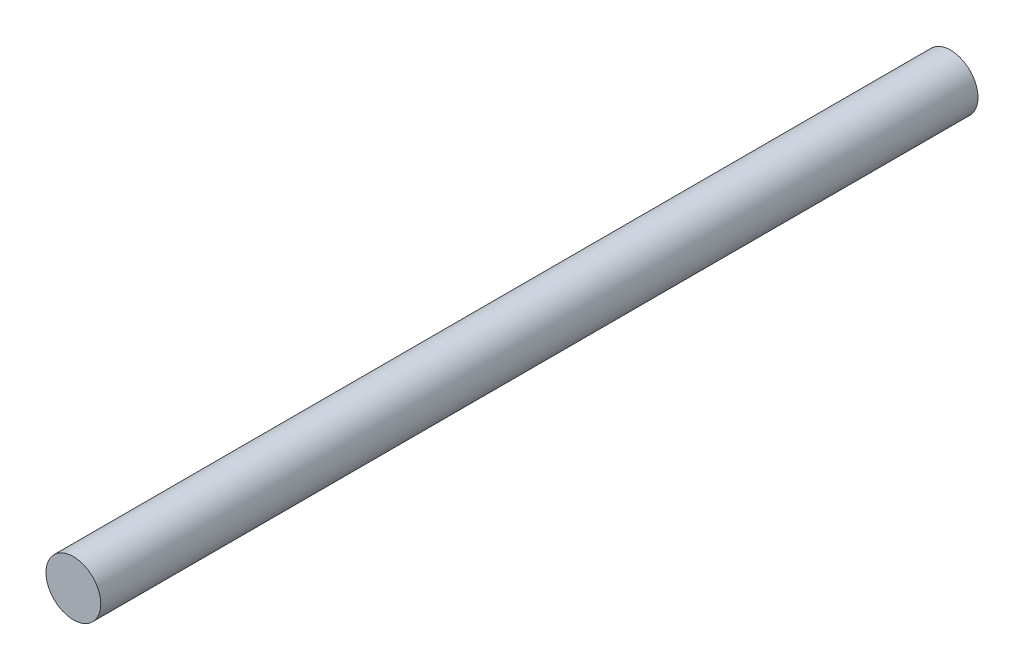
ISO-10303-21;
HEADER;
FILE_DESCRIPTION(('STEP AP214'),'2;1');
FILE_NAME('part.step','',(''),(''),'','','');
FILE_SCHEMA(('AUTOMOTIVE_DESIGN { 1 0 10303 214 1 1 1 1 }'));
ENDSEC;
DATA;
#1=APPLICATION_CONTEXT('core data for automotive mechanical design processes');
#2=APPLICATION_PROTOCOL_DEFINITION('international standard','automotive_design',2000,#1);
#3=PRODUCT_CONTEXT('',#1,'mechanical');
#4=PRODUCT('Part','Part','',(#3));
#5=PRODUCT_RELATED_PRODUCT_CATEGORY('part','',(#4));
#6=PRODUCT_DEFINITION_FORMATION('','',#4);
#7=PRODUCT_DEFINITION_CONTEXT('part definition',#1,'design');
#8=PRODUCT_DEFINITION('design','',#6,#7);
#9=PRODUCT_DEFINITION_SHAPE('','',#8);
#10=(LENGTH_UNIT() NAMED_UNIT(*) SI_UNIT(.MILLI.,.METRE.));
#11=(NAMED_UNIT(*) PLANE_ANGLE_UNIT() SI_UNIT($,.RADIAN.));
#12=(NAMED_UNIT(*) SI_UNIT($,.STERADIAN.) SOLID_ANGLE_UNIT());
#13=UNCERTAINTY_MEASURE_WITH_UNIT(LENGTH_MEASURE(1.E-05),#10,'distance_accuracy_value','');
#14=(GEOMETRIC_REPRESENTATION_CONTEXT(3) GLOBAL_UNCERTAINTY_ASSIGNED_CONTEXT((#13)) GLOBAL_UNIT_ASSIGNED_CONTEXT((#10,
#11,#12)) REPRESENTATION_CONTEXT('',''));
#15=CARTESIAN_POINT('',(0.,0.,0.));
#16=DIRECTION('',(0.,0.,1.));
#17=DIRECTION('',(1.,0.,0.));
#18=AXIS2_PLACEMENT_3D('',#15,#16,#17);
#19=CARTESIAN_POINT('',(0.,0.,192.));
#20=DIRECTION('',(0.,0.,-1.));
#21=DIRECTION('',(-1.,0.,0.));
#22=AXIS2_PLACEMENT_3D('',#19,#20,#21);
#23=CYLINDRICAL_SURFACE('',#22,6.);
#24=CARTESIAN_POINT('',(0.,0.,192.));
#25=DIRECTION('',(0.,0.,1.));
#26=DIRECTION('',(1.,0.,0.));
#27=AXIS2_PLACEMENT_3D('',#24,#25,#26);
#28=CIRCLE('',#27,6.);
#29=CARTESIAN_POINT('',(6.,0.,192.));
#30=VERTEX_POINT('',#29);
#31=EDGE_CURVE('E10',#30,#30,#28,.T.);
#32=ORIENTED_EDGE('',*,*,#31,.F.);
#33=EDGE_LOOP('',(#32));
#34=FACE_BOUND('',#33,.T.);
#35=CARTESIAN_POINT('',(0.,0.,0.));
#36=DIRECTION('',(0.,0.,1.));
#37=DIRECTION('',(1.,0.,0.));
#38=AXIS2_PLACEMENT_3D('',#35,#36,#37);
#39=CIRCLE('',#38,6.);
#40=CARTESIAN_POINT('',(6.,0.,0.));
#41=VERTEX_POINT('',#40);
#42=EDGE_CURVE('E38',#41,#41,#39,.T.);
#43=ORIENTED_EDGE('',*,*,#42,.T.);
#44=EDGE_LOOP('',(#43));
#45=FACE_BOUND('',#44,.T.);
#46=ADVANCED_FACE('F35',(#34,#45),#23,.T.);
#47=CARTESIAN_POINT('',(0.,0.,192.));
#48=DIRECTION('',(0.,0.,1.));
#49=DIRECTION('',(1.,0.,0.));
#50=AXIS2_PLACEMENT_3D('',#47,#48,#49);
#51=PLANE('',#50);
#52=ORIENTED_EDGE('',*,*,#31,.T.);
#53=EDGE_LOOP('',(#52));
#54=FACE_BOUND('',#53,.T.);
#55=ADVANCED_FACE('F50',(#54),#51,.T.);
#56=CARTESIAN_POINT('',(0.,0.,0.));
#57=DIRECTION('',(0.,0.,1.));
#58=DIRECTION('',(1.,0.,0.));
#59=AXIS2_PLACEMENT_3D('',#56,#57,#58);
#60=PLANE('',#59);
#61=ORIENTED_EDGE('',*,*,#42,.F.);
#62=EDGE_LOOP('',(#61));
#63=FACE_BOUND('',#62,.T.);
#64=ADVANCED_FACE('F48',(#63),#60,.F.);
#65=CLOSED_SHELL('',(#46,#55,#64));
#66=MANIFOLD_SOLID_BREP('B2',#65);
#67=ADVANCED_BREP_SHAPE_REPRESENTATION('',(#18,#66),#14);
#68=SHAPE_DEFINITION_REPRESENTATION(#9,#67);
ENDSEC;
END-ISO-10303-21;
